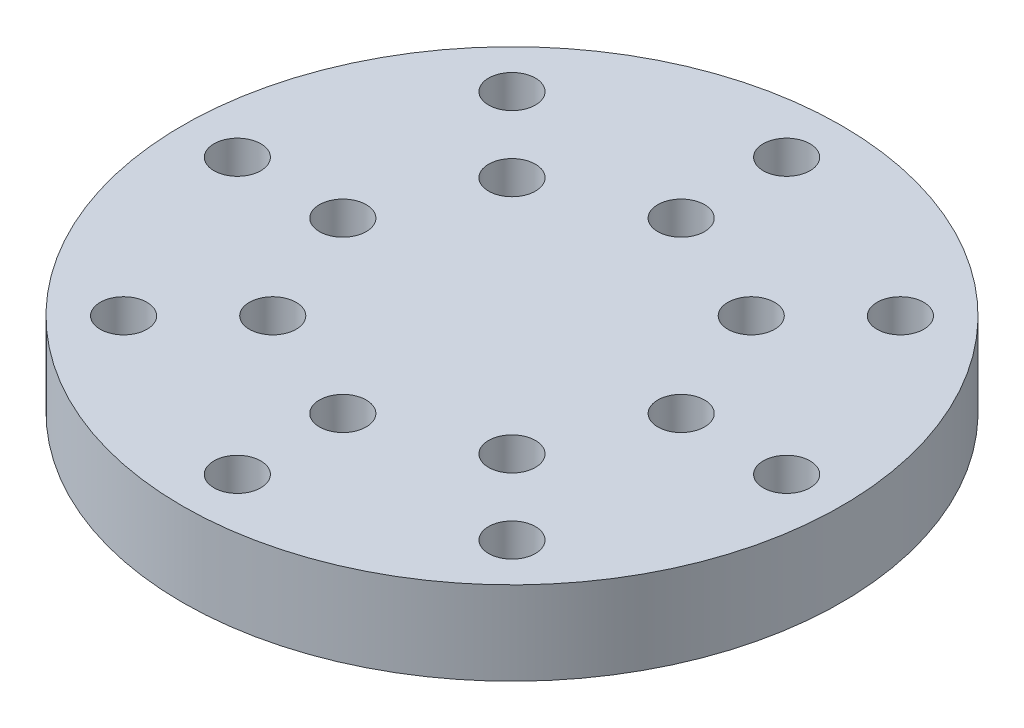
ISO-10303-21;
HEADER;
FILE_DESCRIPTION(('STEP AP214'),'2;1');
FILE_NAME('part.step','',(''),(''),'','','');
FILE_SCHEMA(('AUTOMOTIVE_DESIGN { 1 0 10303 214 1 1 1 1 }'));
ENDSEC;
DATA;
#1=APPLICATION_CONTEXT('core data for automotive mechanical design processes');
#2=APPLICATION_PROTOCOL_DEFINITION('international standard','automotive_design',2000,#1);
#3=PRODUCT_CONTEXT('',#1,'mechanical');
#4=PRODUCT('Part','Part','',(#3));
#5=PRODUCT_RELATED_PRODUCT_CATEGORY('part','',(#4));
#6=PRODUCT_DEFINITION_FORMATION('','',#4);
#7=PRODUCT_DEFINITION_CONTEXT('part definition',#1,'design');
#8=PRODUCT_DEFINITION('design','',#6,#7);
#9=PRODUCT_DEFINITION_SHAPE('','',#8);
#10=(LENGTH_UNIT() NAMED_UNIT(*) SI_UNIT(.MILLI.,.METRE.));
#11=(NAMED_UNIT(*) PLANE_ANGLE_UNIT() SI_UNIT($,.RADIAN.));
#12=(NAMED_UNIT(*) SI_UNIT($,.STERADIAN.) SOLID_ANGLE_UNIT());
#13=UNCERTAINTY_MEASURE_WITH_UNIT(LENGTH_MEASURE(1.E-05),#10,'distance_accuracy_value','');
#14=(GEOMETRIC_REPRESENTATION_CONTEXT(3) GLOBAL_UNCERTAINTY_ASSIGNED_CONTEXT((#13)) GLOBAL_UNIT_ASSIGNED_CONTEXT((#10,
#11,#12)) REPRESENTATION_CONTEXT('',''));
#15=CARTESIAN_POINT('',(0.,0.,0.));
#16=DIRECTION('',(0.,0.,1.));
#17=DIRECTION('',(1.,0.,0.));
#18=AXIS2_PLACEMENT_3D('',#15,#16,#17);
#19=CARTESIAN_POINT('',(0.,4.826,0.));
#20=DIRECTION('',(0.,-1.,0.));
#21=DIRECTION('',(0.,0.,-1.));
#22=AXIS2_PLACEMENT_3D('',#19,#20,#21);
#23=CYLINDRICAL_SURFACE('',#22,19.05);
#24=CARTESIAN_POINT('',(0.,4.826,0.));
#25=DIRECTION('',(0.,1.,0.));
#26=DIRECTION('',(0.,0.,1.));
#27=AXIS2_PLACEMENT_3D('',#24,#25,#26);
#28=CIRCLE('',#27,19.05);
#29=CARTESIAN_POINT('',(0.,4.826,19.05));
#30=VERTEX_POINT('',#29);
#31=EDGE_CURVE('E10',#30,#30,#28,.T.);
#32=ORIENTED_EDGE('',*,*,#31,.F.);
#33=EDGE_LOOP('',(#32));
#34=FACE_BOUND('',#33,.T.);
#35=CARTESIAN_POINT('',(0.,0.,0.));
#36=DIRECTION('',(0.,1.,0.));
#37=DIRECTION('',(0.,0.,1.));
#38=AXIS2_PLACEMENT_3D('',#35,#36,#37);
#39=CIRCLE('',#38,19.05);
#40=CARTESIAN_POINT('',(0.,0.,19.05));
#41=VERTEX_POINT('',#40);
#42=EDGE_CURVE('E34',#41,#41,#39,.T.);
#43=ORIENTED_EDGE('',*,*,#42,.T.);
#44=EDGE_LOOP('',(#43));
#45=FACE_BOUND('',#44,.T.);
#46=ADVANCED_FACE('F31',(#34,#45),#23,.T.);
#47=CARTESIAN_POINT('',(0.,4.826,0.));
#48=DIRECTION('',(0.,1.,0.));
#49=DIRECTION('',(0.,0.,1.));
#50=AXIS2_PLACEMENT_3D('',#47,#48,#49);
#51=PLANE('',#50);
#52=CARTESIAN_POINT('',(9.779,4.826,0.));
#53=DIRECTION('',(0.,1.,0.));
#54=DIRECTION('',(-1.,0.,0.));
#55=AXIS2_PLACEMENT_3D('',#52,#53,#54);
#56=CIRCLE('',#55,1.35254999999999);
#57=CARTESIAN_POINT('',(8.42645000000001,4.826,0.));
#58=VERTEX_POINT('',#57);
#59=EDGE_CURVE('E120',#58,#58,#56,.T.);
#60=ORIENTED_EDGE('',*,*,#59,.F.);
#61=EDGE_LOOP('',(#60));
#62=FACE_BOUND('',#61,.T.);
#63=CARTESIAN_POINT('',(6.91479721322321,4.826,6.91479721322328));
#64=DIRECTION('',(0.,1.,0.));
#65=DIRECTION('',(-0.707106781186544,0.,-0.707106781186551));
#66=AXIS2_PLACEMENT_3D('',#63,#64,#65);
#67=CIRCLE('',#66,1.35254999999999);
#68=CARTESIAN_POINT('',(5.95839993632936,4.826,5.95839993632942));
#69=VERTEX_POINT('',#68);
#70=EDGE_CURVE('E114',#69,#69,#67,.T.);
#71=ORIENTED_EDGE('',*,*,#70,.F.);
#72=EDGE_LOOP('',(#71));
#73=FACE_BOUND('',#72,.T.);
#74=CARTESIAN_POINT('',(0.,4.826,9.779));
#75=DIRECTION('',(0.,1.,0.));
#76=DIRECTION('',(0.,0.,-1.));
#77=AXIS2_PLACEMENT_3D('',#74,#75,#76);
#78=CIRCLE('',#77,1.35254999999999);
#79=CARTESIAN_POINT('',(0.,4.826,8.42645000000001));
#80=VERTEX_POINT('',#79);
#81=EDGE_CURVE('E106',#80,#80,#78,.T.);
#82=ORIENTED_EDGE('',*,*,#81,.F.);
#83=EDGE_LOOP('',(#82));
#84=FACE_BOUND('',#83,.T.);
#85=CARTESIAN_POINT('',(-6.91479721322331,4.826,6.91479721322319));
#86=DIRECTION('',(0.,1.,0.));
#87=DIRECTION('',(0.707106781186554,0.,-0.707106781186541));
#88=AXIS2_PLACEMENT_3D('',#85,#86,#87);
#89=CIRCLE('',#88,1.35254999999999);
#90=CARTESIAN_POINT('',(-5.95839993632944,4.826,5.95839993632934));
#91=VERTEX_POINT('',#90);
#92=EDGE_CURVE('E107',#91,#91,#89,.T.);
#93=ORIENTED_EDGE('',*,*,#92,.F.);
#94=EDGE_LOOP('',(#93));
#95=FACE_BOUND('',#94,.T.);
#96=CARTESIAN_POINT('',(-9.779,4.826,-1.02429588037641E-13));
#97=DIRECTION('',(0.,1.,0.));
#98=DIRECTION('',(1.,0.,0.));
#99=AXIS2_PLACEMENT_3D('',#96,#97,#98);
#100=CIRCLE('',#99,1.35254999999999);
#101=CARTESIAN_POINT('',(-8.42645000000001,4.826,0.));
#102=VERTEX_POINT('',#101);
#103=EDGE_CURVE('E130',#102,#102,#100,.T.);
#104=ORIENTED_EDGE('',*,*,#103,.F.);
#105=EDGE_LOOP('',(#104));
#106=FACE_BOUND('',#105,.T.);
#107=CARTESIAN_POINT('',(-6.91479721322316,4.826,-6.91479721322333));
#108=DIRECTION('',(0.,1.,0.));
#109=DIRECTION('',(0.707106781186539,0.,0.707106781186556));
#110=AXIS2_PLACEMENT_3D('',#107,#108,#109);
#111=CIRCLE('',#110,1.35254999999999);
#112=CARTESIAN_POINT('',(-5.95839993632932,4.826,-5.95839993632946));
#113=VERTEX_POINT('',#112);
#114=EDGE_CURVE('E131',#113,#113,#111,.T.);
#115=ORIENTED_EDGE('',*,*,#114,.F.);
#116=EDGE_LOOP('',(#115));
#117=FACE_BOUND('',#116,.T.);
#118=CARTESIAN_POINT('',(6.91479721322326,4.826,-6.91479721322324));
#119=DIRECTION('',(0.,1.,0.));
#120=DIRECTION('',(-0.707106781186549,0.,0.707106781186546));
#121=AXIS2_PLACEMENT_3D('',#118,#119,#120);
#122=CIRCLE('',#121,1.35254999999999);
#123=CARTESIAN_POINT('',(5.9583999363294,4.826,-5.95839993632938));
#124=VERTEX_POINT('',#123);
#125=EDGE_CURVE('E99',#124,#124,#122,.T.);
#126=ORIENTED_EDGE('',*,*,#125,.F.);
#127=EDGE_LOOP('',(#126));
#128=FACE_BOUND('',#127,.T.);
#129=CARTESIAN_POINT('',(15.875,4.826,0.));
#130=DIRECTION('',(0.,1.,0.));
#131=DIRECTION('',(-1.,0.,0.));
#132=AXIS2_PLACEMENT_3D('',#129,#130,#131);
#133=CIRCLE('',#132,1.35254999999999);
#134=CARTESIAN_POINT('',(14.52245,4.826,0.));
#135=VERTEX_POINT('',#134);
#136=EDGE_CURVE('E78',#135,#135,#133,.T.);
#137=ORIENTED_EDGE('',*,*,#136,.F.);
#138=EDGE_LOOP('',(#137));
#139=FACE_BOUND('',#138,.T.);
#140=CARTESIAN_POINT('',(11.2253201513364,4.826,11.2253201513365));
#141=DIRECTION('',(0.,1.,0.));
#142=DIRECTION('',(-0.707106781186544,0.,-0.707106781186551));
#143=AXIS2_PLACEMENT_3D('',#140,#141,#142);
#144=CIRCLE('',#143,1.35254999999999);
#145=CARTESIAN_POINT('',(10.2689228744425,4.826,10.2689228744426));
#146=VERTEX_POINT('',#145);
#147=EDGE_CURVE('E72',#146,#146,#144,.T.);
#148=ORIENTED_EDGE('',*,*,#147,.F.);
#149=EDGE_LOOP('',(#148));
#150=FACE_BOUND('',#149,.T.);
#151=CARTESIAN_POINT('',(0.,4.826,15.875));
#152=DIRECTION('',(0.,1.,0.));
#153=DIRECTION('',(0.,0.,-1.));
#154=AXIS2_PLACEMENT_3D('',#151,#152,#153);
#155=CIRCLE('',#154,1.35254999999999);
#156=CARTESIAN_POINT('',(0.,4.826,14.52245));
#157=VERTEX_POINT('',#156);
#158=EDGE_CURVE('E64',#157,#157,#155,.T.);
#159=ORIENTED_EDGE('',*,*,#158,.F.);
#160=EDGE_LOOP('',(#159));
#161=FACE_BOUND('',#160,.T.);
#162=CARTESIAN_POINT('',(-11.2253201513365,4.826,11.2253201513363));
#163=DIRECTION('',(0.,1.,0.));
#164=DIRECTION('',(0.707106781186554,0.,-0.707106781186541));
#165=AXIS2_PLACEMENT_3D('',#162,#163,#164);
#166=CIRCLE('',#165,1.35254999999999);
#167=CARTESIAN_POINT('',(-10.2689228744427,4.826,10.2689228744425));
#168=VERTEX_POINT('',#167);
#169=EDGE_CURVE('E65',#168,#168,#166,.T.);
#170=ORIENTED_EDGE('',*,*,#169,.F.);
#171=EDGE_LOOP('',(#170));
#172=FACE_BOUND('',#171,.T.);
#173=CARTESIAN_POINT('',(-15.875,4.826,-1.66281798762404E-13));
#174=DIRECTION('',(0.,1.,0.));
#175=DIRECTION('',(1.,0.,0.));
#176=AXIS2_PLACEMENT_3D('',#173,#174,#175);
#177=CIRCLE('',#176,1.35254999999999);
#178=CARTESIAN_POINT('',(-14.52245,4.826,-1.52114589507848E-13));
#179=VERTEX_POINT('',#178);
#180=EDGE_CURVE('E88',#179,#179,#177,.T.);
#181=ORIENTED_EDGE('',*,*,#180,.F.);
#182=EDGE_LOOP('',(#181));
#183=FACE_BOUND('',#182,.T.);
#184=CARTESIAN_POINT('',(-11.2253201513363,4.826,-11.2253201513366));
#185=DIRECTION('',(0.,1.,0.));
#186=DIRECTION('',(0.707106781186539,0.,0.707106781186556));
#187=AXIS2_PLACEMENT_3D('',#184,#185,#186);
#188=CIRCLE('',#187,1.35254999999999);
#189=CARTESIAN_POINT('',(-10.2689228744425,4.826,-10.2689228744427));
#190=VERTEX_POINT('',#189);
#191=EDGE_CURVE('E89',#190,#190,#188,.T.);
#192=ORIENTED_EDGE('',*,*,#191,.F.);
#193=EDGE_LOOP('',(#192));
#194=FACE_BOUND('',#193,.T.);
#195=CARTESIAN_POINT('',(11.2253201513365,4.826,-11.2253201513364));
#196=DIRECTION('',(0.,1.,0.));
#197=DIRECTION('',(-0.707106781186549,0.,0.707106781186546));
#198=AXIS2_PLACEMENT_3D('',#195,#196,#197);
#199=CIRCLE('',#198,1.35254999999999);
#200=CARTESIAN_POINT('',(10.2689228744426,4.826,-10.2689228744426));
#201=VERTEX_POINT('',#200);
#202=EDGE_CURVE('E57',#201,#201,#199,.T.);
#203=ORIENTED_EDGE('',*,*,#202,.F.);
#204=EDGE_LOOP('',(#203));
#205=FACE_BOUND('',#204,.T.);
#206=CARTESIAN_POINT('',(0.,4.826,-15.875));
#207=DIRECTION('',(0.,1.,0.));
#208=DIRECTION('',(0.,0.,1.));
#209=AXIS2_PLACEMENT_3D('',#206,#207,#208);
#210=CIRCLE('',#209,1.35254999999999);
#211=CARTESIAN_POINT('',(0.,4.826,-14.52245));
#212=VERTEX_POINT('',#211);
#213=EDGE_CURVE('E48',#212,#212,#210,.T.);
#214=ORIENTED_EDGE('',*,*,#213,.F.);
#215=EDGE_LOOP('',(#214));
#216=FACE_BOUND('',#215,.T.);
#217=CARTESIAN_POINT('',(0.,4.826,-9.779));
#218=DIRECTION('',(0.,1.,0.));
#219=DIRECTION('',(0.,0.,1.));
#220=AXIS2_PLACEMENT_3D('',#217,#218,#219);
#221=CIRCLE('',#220,1.35254999999999);
#222=CARTESIAN_POINT('',(0.,4.826,-8.42645000000001));
#223=VERTEX_POINT('',#222);
#224=EDGE_CURVE('E41',#223,#223,#221,.T.);
#225=ORIENTED_EDGE('',*,*,#224,.F.);
#226=EDGE_LOOP('',(#225));
#227=FACE_BOUND('',#226,.T.);
#228=ORIENTED_EDGE('',*,*,#31,.T.);
#229=EDGE_LOOP('',(#228));
#230=FACE_BOUND('',#229,.T.);
#231=ADVANCED_FACE('F142',(#62,#73,#84,#95,#106,#117,#128,#139,#150,#161,#172,#183,#194,#205,
#216,#227,#230),#51,.T.);
#232=CARTESIAN_POINT('',(0.,0.,0.));
#233=DIRECTION('',(0.,1.,0.));
#234=DIRECTION('',(0.,0.,1.));
#235=AXIS2_PLACEMENT_3D('',#232,#233,#234);
#236=PLANE('',#235);
#237=CARTESIAN_POINT('',(9.779,0.,0.));
#238=DIRECTION('',(0.,-1.,0.));
#239=DIRECTION('',(1.,0.,0.));
#240=AXIS2_PLACEMENT_3D('',#237,#238,#239);
#241=CIRCLE('',#240,1.35254999999999);
#242=CARTESIAN_POINT('',(11.13155,0.,0.));
#243=VERTEX_POINT('',#242);
#244=EDGE_CURVE('E102',#243,#243,#241,.T.);
#245=ORIENTED_EDGE('',*,*,#244,.F.);
#246=EDGE_LOOP('',(#245));
#247=FACE_BOUND('',#246,.T.);
#248=CARTESIAN_POINT('',(6.91479721322321,0.,6.91479721322328));
#249=DIRECTION('',(0.,-1.,0.));
#250=DIRECTION('',(0.707106781186544,0.,0.707106781186551));
#251=AXIS2_PLACEMENT_3D('',#248,#249,#250);
#252=CIRCLE('',#251,1.35254999999999);
#253=CARTESIAN_POINT('',(7.87119449011706,0.,7.87119449011715));
#254=VERTEX_POINT('',#253);
#255=EDGE_CURVE('E117',#254,#254,#252,.T.);
#256=ORIENTED_EDGE('',*,*,#255,.F.);
#257=EDGE_LOOP('',(#256));
#258=FACE_BOUND('',#257,.T.);
#259=CARTESIAN_POINT('',(0.,0.,9.779));
#260=DIRECTION('',(0.,-1.,0.));
#261=DIRECTION('',(0.,0.,1.));
#262=AXIS2_PLACEMENT_3D('',#259,#260,#261);
#263=CIRCLE('',#262,1.35254999999999);
#264=CARTESIAN_POINT('',(0.,0.,11.13155));
#265=VERTEX_POINT('',#264);
#266=EDGE_CURVE('E111',#265,#265,#263,.T.);
#267=ORIENTED_EDGE('',*,*,#266,.F.);
#268=EDGE_LOOP('',(#267));
#269=FACE_BOUND('',#268,.T.);
#270=CARTESIAN_POINT('',(-6.91479721322331,0.,6.91479721322319));
#271=DIRECTION('',(0.,-1.,0.));
#272=DIRECTION('',(-0.707106781186554,0.,0.707106781186541));
#273=AXIS2_PLACEMENT_3D('',#270,#271,#272);
#274=CIRCLE('',#273,1.35254999999999);
#275=CARTESIAN_POINT('',(-7.87119449011717,0.,7.87119449011704));
#276=VERTEX_POINT('',#275);
#277=EDGE_CURVE('E103',#276,#276,#274,.T.);
#278=ORIENTED_EDGE('',*,*,#277,.F.);
#279=EDGE_LOOP('',(#278));
#280=FACE_BOUND('',#279,.T.);
#281=CARTESIAN_POINT('',(-9.779,0.,-1.02429588037641E-13));
#282=DIRECTION('',(0.,-1.,0.));
#283=DIRECTION('',(-1.,0.,0.));
#284=AXIS2_PLACEMENT_3D('',#281,#282,#283);
#285=CIRCLE('',#284,1.35254999999999);
#286=CARTESIAN_POINT('',(-11.13155,0.,-1.16596797292198E-13));
#287=VERTEX_POINT('',#286);
#288=EDGE_CURVE('E110',#287,#287,#285,.T.);
#289=ORIENTED_EDGE('',*,*,#288,.F.);
#290=EDGE_LOOP('',(#289));
#291=FACE_BOUND('',#290,.T.);
#292=CARTESIAN_POINT('',(-6.91479721322316,0.,-6.91479721322333));
#293=DIRECTION('',(0.,-1.,0.));
#294=DIRECTION('',(-0.707106781186539,0.,-0.707106781186556));
#295=AXIS2_PLACEMENT_3D('',#292,#293,#294);
#296=CIRCLE('',#295,1.35254999999999);
#297=CARTESIAN_POINT('',(-7.87119449011701,0.,-7.8711944901172));
#298=VERTEX_POINT('',#297);
#299=EDGE_CURVE('E127',#298,#298,#296,.T.);
#300=ORIENTED_EDGE('',*,*,#299,.F.);
#301=EDGE_LOOP('',(#300));
#302=FACE_BOUND('',#301,.T.);
#303=CARTESIAN_POINT('',(6.91479721322326,0.,-6.91479721322324));
#304=DIRECTION('',(0.,-1.,0.));
#305=DIRECTION('',(0.707106781186549,0.,-0.707106781186546));
#306=AXIS2_PLACEMENT_3D('',#303,#304,#305);
#307=CIRCLE('',#306,1.35254999999999);
#308=CARTESIAN_POINT('',(7.87119449011712,0.,-7.87119449011709));
#309=VERTEX_POINT('',#308);
#310=EDGE_CURVE('E92',#309,#309,#307,.T.);
#311=ORIENTED_EDGE('',*,*,#310,.F.);
#312=EDGE_LOOP('',(#311));
#313=FACE_BOUND('',#312,.T.);
#314=CARTESIAN_POINT('',(15.875,0.,0.));
#315=DIRECTION('',(0.,-1.,0.));
#316=DIRECTION('',(1.,0.,0.));
#317=AXIS2_PLACEMENT_3D('',#314,#315,#316);
#318=CIRCLE('',#317,1.35254999999999);
#319=CARTESIAN_POINT('',(17.22755,0.,0.));
#320=VERTEX_POINT('',#319);
#321=EDGE_CURVE('E60',#320,#320,#318,.T.);
#322=ORIENTED_EDGE('',*,*,#321,.F.);
#323=EDGE_LOOP('',(#322));
#324=FACE_BOUND('',#323,.T.);
#325=CARTESIAN_POINT('',(11.2253201513364,0.,11.2253201513365));
#326=DIRECTION('',(0.,-1.,0.));
#327=DIRECTION('',(0.707106781186544,0.,0.707106781186551));
#328=AXIS2_PLACEMENT_3D('',#325,#326,#327);
#329=CIRCLE('',#328,1.35254999999999);
#330=CARTESIAN_POINT('',(12.1817174282302,0.,12.1817174282304));
#331=VERTEX_POINT('',#330);
#332=EDGE_CURVE('E75',#331,#331,#329,.T.);
#333=ORIENTED_EDGE('',*,*,#332,.F.);
#334=EDGE_LOOP('',(#333));
#335=FACE_BOUND('',#334,.T.);
#336=CARTESIAN_POINT('',(0.,0.,15.875));
#337=DIRECTION('',(0.,-1.,0.));
#338=DIRECTION('',(0.,0.,1.));
#339=AXIS2_PLACEMENT_3D('',#336,#337,#338);
#340=CIRCLE('',#339,1.35254999999999);
#341=CARTESIAN_POINT('',(0.,0.,17.22755));
#342=VERTEX_POINT('',#341);
#343=EDGE_CURVE('E69',#342,#342,#340,.T.);
#344=ORIENTED_EDGE('',*,*,#343,.F.);
#345=EDGE_LOOP('',(#344));
#346=FACE_BOUND('',#345,.T.);
#347=CARTESIAN_POINT('',(-11.2253201513365,0.,11.2253201513363));
#348=DIRECTION('',(0.,-1.,0.));
#349=DIRECTION('',(-0.707106781186554,0.,0.707106781186541));
#350=AXIS2_PLACEMENT_3D('',#347,#348,#349);
#351=CIRCLE('',#350,1.35254999999999);
#352=CARTESIAN_POINT('',(-12.1817174282304,0.,12.1817174282302));
#353=VERTEX_POINT('',#352);
#354=EDGE_CURVE('E61',#353,#353,#351,.T.);
#355=ORIENTED_EDGE('',*,*,#354,.F.);
#356=EDGE_LOOP('',(#355));
#357=FACE_BOUND('',#356,.T.);
#358=CARTESIAN_POINT('',(-15.875,0.,-1.66281798762404E-13));
#359=DIRECTION('',(0.,-1.,0.));
#360=DIRECTION('',(-1.,0.,0.));
#361=AXIS2_PLACEMENT_3D('',#358,#359,#360);
#362=CIRCLE('',#361,1.35254999999999);
#363=CARTESIAN_POINT('',(-17.22755,0.,-1.80449008016961E-13));
#364=VERTEX_POINT('',#363);
#365=EDGE_CURVE('E68',#364,#364,#362,.T.);
#366=ORIENTED_EDGE('',*,*,#365,.F.);
#367=EDGE_LOOP('',(#366));
#368=FACE_BOUND('',#367,.T.);
#369=CARTESIAN_POINT('',(-11.2253201513363,0.,-11.2253201513366));
#370=DIRECTION('',(0.,-1.,0.));
#371=DIRECTION('',(-0.707106781186539,0.,-0.707106781186556));
#372=AXIS2_PLACEMENT_3D('',#369,#370,#371);
#373=CIRCLE('',#372,1.35254999999999);
#374=CARTESIAN_POINT('',(-12.1817174282302,0.,-12.1817174282304));
#375=VERTEX_POINT('',#374);
#376=EDGE_CURVE('E85',#375,#375,#373,.T.);
#377=ORIENTED_EDGE('',*,*,#376,.F.);
#378=EDGE_LOOP('',(#377));
#379=FACE_BOUND('',#378,.T.);
#380=CARTESIAN_POINT('',(11.2253201513365,0.,-11.2253201513364));
#381=DIRECTION('',(0.,-1.,0.));
#382=DIRECTION('',(0.707106781186549,0.,-0.707106781186546));
#383=AXIS2_PLACEMENT_3D('',#380,#381,#382);
#384=CIRCLE('',#383,1.35254999999999);
#385=CARTESIAN_POINT('',(12.1817174282303,0.,-12.1817174282303));
#386=VERTEX_POINT('',#385);
#387=EDGE_CURVE('E54',#386,#386,#384,.T.);
#388=ORIENTED_EDGE('',*,*,#387,.F.);
#389=EDGE_LOOP('',(#388));
#390=FACE_BOUND('',#389,.T.);
#391=CARTESIAN_POINT('',(0.,0.,-15.875));
#392=DIRECTION('',(0.,-1.,0.));
#393=DIRECTION('',(0.,0.,-1.));
#394=AXIS2_PLACEMENT_3D('',#391,#392,#393);
#395=CIRCLE('',#394,1.35254999999999);
#396=CARTESIAN_POINT('',(0.,0.,-17.22755));
#397=VERTEX_POINT('',#396);
#398=EDGE_CURVE('E51',#397,#397,#395,.T.);
#399=ORIENTED_EDGE('',*,*,#398,.F.);
#400=EDGE_LOOP('',(#399));
#401=FACE_BOUND('',#400,.T.);
#402=CARTESIAN_POINT('',(0.,0.,-9.779));
#403=DIRECTION('',(0.,-1.,0.));
#404=DIRECTION('',(0.,0.,-1.));
#405=AXIS2_PLACEMENT_3D('',#402,#403,#404);
#406=CIRCLE('',#405,1.35254999999999);
#407=CARTESIAN_POINT('',(0.,0.,-11.13155));
#408=VERTEX_POINT('',#407);
#409=EDGE_CURVE('E45',#408,#408,#406,.T.);
#410=ORIENTED_EDGE('',*,*,#409,.F.);
#411=EDGE_LOOP('',(#410));
#412=FACE_BOUND('',#411,.T.);
#413=ORIENTED_EDGE('',*,*,#42,.F.);
#414=EDGE_LOOP('',(#413));
#415=FACE_BOUND('',#414,.T.);
#416=ADVANCED_FACE('F145',(#247,#258,#269,#280,#291,#302,#313,#324,#335,#346,#357,#368,#379,
#390,#401,#412,#415),#236,.F.);
#417=CARTESIAN_POINT('',(0.,0.,-9.779));
#418=DIRECTION('',(0.,-1.,0.));
#419=DIRECTION('',(0.,0.,-1.));
#420=AXIS2_PLACEMENT_3D('',#417,#418,#419);
#421=CYLINDRICAL_SURFACE('',#420,1.35254999999999);
#422=ORIENTED_EDGE('',*,*,#224,.T.);
#423=EDGE_LOOP('',(#422));
#424=FACE_BOUND('',#423,.T.);
#425=ORIENTED_EDGE('',*,*,#409,.T.);
#426=EDGE_LOOP('',(#425));
#427=FACE_BOUND('',#426,.T.);
#428=ADVANCED_FACE('F170',(#424,#427),#421,.F.);
#429=CARTESIAN_POINT('',(0.,0.,-15.875));
#430=DIRECTION('',(0.,-1.,0.));
#431=DIRECTION('',(0.,0.,-1.));
#432=AXIS2_PLACEMENT_3D('',#429,#430,#431);
#433=CYLINDRICAL_SURFACE('',#432,1.35254999999999);
#434=ORIENTED_EDGE('',*,*,#213,.T.);
#435=EDGE_LOOP('',(#434));
#436=FACE_BOUND('',#435,.T.);
#437=ORIENTED_EDGE('',*,*,#398,.T.);
#438=EDGE_LOOP('',(#437));
#439=FACE_BOUND('',#438,.T.);
#440=ADVANCED_FACE('F173',(#436,#439),#433,.F.);
#441=CARTESIAN_POINT('',(11.2253201513365,0.,-11.2253201513364));
#442=DIRECTION('',(0.,-1.,0.));
#443=DIRECTION('',(0.707106781186549,0.,-0.707106781186546));
#444=AXIS2_PLACEMENT_3D('',#441,#442,#443);
#445=CYLINDRICAL_SURFACE('',#444,1.35254999999999);
#446=ORIENTED_EDGE('',*,*,#202,.T.);
#447=EDGE_LOOP('',(#446));
#448=FACE_BOUND('',#447,.T.);
#449=ORIENTED_EDGE('',*,*,#387,.T.);
#450=EDGE_LOOP('',(#449));
#451=FACE_BOUND('',#450,.T.);
#452=ADVANCED_FACE('F205',(#448,#451),#445,.F.);
#453=CARTESIAN_POINT('',(-11.2253201513363,0.,-11.2253201513366));
#454=DIRECTION('',(0.,-1.,0.));
#455=DIRECTION('',(-0.707106781186539,0.,-0.707106781186556));
#456=AXIS2_PLACEMENT_3D('',#453,#454,#455);
#457=CYLINDRICAL_SURFACE('',#456,1.35254999999999);
#458=ORIENTED_EDGE('',*,*,#191,.T.);
#459=EDGE_LOOP('',(#458));
#460=FACE_BOUND('',#459,.T.);
#461=ORIENTED_EDGE('',*,*,#376,.T.);
#462=EDGE_LOOP('',(#461));
#463=FACE_BOUND('',#462,.T.);
#464=ADVANCED_FACE('F212',(#460,#463),#457,.F.);
#465=CARTESIAN_POINT('',(-15.875,0.,-1.66281798762404E-13));
#466=DIRECTION('',(0.,-1.,0.));
#467=DIRECTION('',(-1.,0.,0.));
#468=AXIS2_PLACEMENT_3D('',#465,#466,#467);
#469=CYLINDRICAL_SURFACE('',#468,1.35254999999999);
#470=ORIENTED_EDGE('',*,*,#180,.T.);
#471=EDGE_LOOP('',(#470));
#472=FACE_BOUND('',#471,.T.);
#473=ORIENTED_EDGE('',*,*,#365,.T.);
#474=EDGE_LOOP('',(#473));
#475=FACE_BOUND('',#474,.T.);
#476=ADVANCED_FACE('F220',(#472,#475),#469,.F.);
#477=CARTESIAN_POINT('',(-11.2253201513365,0.,11.2253201513363));
#478=DIRECTION('',(0.,-1.,0.));
#479=DIRECTION('',(-0.707106781186554,0.,0.707106781186541));
#480=AXIS2_PLACEMENT_3D('',#477,#478,#479);
#481=CYLINDRICAL_SURFACE('',#480,1.35254999999999);
#482=ORIENTED_EDGE('',*,*,#169,.T.);
#483=EDGE_LOOP('',(#482));
#484=FACE_BOUND('',#483,.T.);
#485=ORIENTED_EDGE('',*,*,#354,.T.);
#486=EDGE_LOOP('',(#485));
#487=FACE_BOUND('',#486,.T.);
#488=ADVANCED_FACE('F228',(#484,#487),#481,.F.);
#489=CARTESIAN_POINT('',(0.,0.,15.875));
#490=DIRECTION('',(0.,-1.,0.));
#491=DIRECTION('',(0.,0.,1.));
#492=AXIS2_PLACEMENT_3D('',#489,#490,#491);
#493=CYLINDRICAL_SURFACE('',#492,1.35254999999999);
#494=ORIENTED_EDGE('',*,*,#158,.T.);
#495=EDGE_LOOP('',(#494));
#496=FACE_BOUND('',#495,.T.);
#497=ORIENTED_EDGE('',*,*,#343,.T.);
#498=EDGE_LOOP('',(#497));
#499=FACE_BOUND('',#498,.T.);
#500=ADVANCED_FACE('F236',(#496,#499),#493,.F.);
#501=CARTESIAN_POINT('',(11.2253201513364,0.,11.2253201513365));
#502=DIRECTION('',(0.,-1.,0.));
#503=DIRECTION('',(0.707106781186544,0.,0.707106781186551));
#504=AXIS2_PLACEMENT_3D('',#501,#502,#503);
#505=CYLINDRICAL_SURFACE('',#504,1.35254999999999);
#506=ORIENTED_EDGE('',*,*,#147,.T.);
#507=EDGE_LOOP('',(#506));
#508=FACE_BOUND('',#507,.T.);
#509=ORIENTED_EDGE('',*,*,#332,.T.);
#510=EDGE_LOOP('',(#509));
#511=FACE_BOUND('',#510,.T.);
#512=ADVANCED_FACE('F244',(#508,#511),#505,.F.);
#513=CARTESIAN_POINT('',(15.875,0.,0.));
#514=DIRECTION('',(0.,-1.,0.));
#515=DIRECTION('',(1.,0.,0.));
#516=AXIS2_PLACEMENT_3D('',#513,#514,#515);
#517=CYLINDRICAL_SURFACE('',#516,1.35254999999999);
#518=ORIENTED_EDGE('',*,*,#136,.T.);
#519=EDGE_LOOP('',(#518));
#520=FACE_BOUND('',#519,.T.);
#521=ORIENTED_EDGE('',*,*,#321,.T.);
#522=EDGE_LOOP('',(#521));
#523=FACE_BOUND('',#522,.T.);
#524=ADVANCED_FACE('F252',(#520,#523),#517,.F.);
#525=CARTESIAN_POINT('',(6.91479721322326,0.,-6.91479721322324));
#526=DIRECTION('',(0.,-1.,0.));
#527=DIRECTION('',(0.707106781186549,0.,-0.707106781186546));
#528=AXIS2_PLACEMENT_3D('',#525,#526,#527);
#529=CYLINDRICAL_SURFACE('',#528,1.35254999999999);
#530=ORIENTED_EDGE('',*,*,#125,.T.);
#531=EDGE_LOOP('',(#530));
#532=FACE_BOUND('',#531,.T.);
#533=ORIENTED_EDGE('',*,*,#310,.T.);
#534=EDGE_LOOP('',(#533));
#535=FACE_BOUND('',#534,.T.);
#536=ADVANCED_FACE('F260',(#532,#535),#529,.F.);
#537=CARTESIAN_POINT('',(-6.91479721322316,0.,-6.91479721322333));
#538=DIRECTION('',(0.,-1.,0.));
#539=DIRECTION('',(-0.707106781186539,0.,-0.707106781186556));
#540=AXIS2_PLACEMENT_3D('',#537,#538,#539);
#541=CYLINDRICAL_SURFACE('',#540,1.35254999999999);
#542=ORIENTED_EDGE('',*,*,#114,.T.);
#543=EDGE_LOOP('',(#542));
#544=FACE_BOUND('',#543,.T.);
#545=ORIENTED_EDGE('',*,*,#299,.T.);
#546=EDGE_LOOP('',(#545));
#547=FACE_BOUND('',#546,.T.);
#548=ADVANCED_FACE('F268',(#544,#547),#541,.F.);
#549=CARTESIAN_POINT('',(-9.779,0.,-1.02429588037641E-13));
#550=DIRECTION('',(0.,-1.,0.));
#551=DIRECTION('',(-1.,0.,0.));
#552=AXIS2_PLACEMENT_3D('',#549,#550,#551);
#553=CYLINDRICAL_SURFACE('',#552,1.35254999999999);
#554=ORIENTED_EDGE('',*,*,#103,.T.);
#555=EDGE_LOOP('',(#554));
#556=FACE_BOUND('',#555,.T.);
#557=ORIENTED_EDGE('',*,*,#288,.T.);
#558=EDGE_LOOP('',(#557));
#559=FACE_BOUND('',#558,.T.);
#560=ADVANCED_FACE('F139',(#556,#559),#553,.F.);
#561=CARTESIAN_POINT('',(-6.91479721322331,0.,6.91479721322319));
#562=DIRECTION('',(0.,-1.,0.));
#563=DIRECTION('',(-0.707106781186554,0.,0.707106781186541));
#564=AXIS2_PLACEMENT_3D('',#561,#562,#563);
#565=CYLINDRICAL_SURFACE('',#564,1.35254999999999);
#566=ORIENTED_EDGE('',*,*,#92,.T.);
#567=EDGE_LOOP('',(#566));
#568=FACE_BOUND('',#567,.T.);
#569=ORIENTED_EDGE('',*,*,#277,.T.);
#570=EDGE_LOOP('',(#569));
#571=FACE_BOUND('',#570,.T.);
#572=ADVANCED_FACE('F283',(#568,#571),#565,.F.);
#573=CARTESIAN_POINT('',(0.,0.,9.779));
#574=DIRECTION('',(0.,-1.,0.));
#575=DIRECTION('',(0.,0.,1.));
#576=AXIS2_PLACEMENT_3D('',#573,#574,#575);
#577=CYLINDRICAL_SURFACE('',#576,1.35254999999999);
#578=ORIENTED_EDGE('',*,*,#81,.T.);
#579=EDGE_LOOP('',(#578));
#580=FACE_BOUND('',#579,.T.);
#581=ORIENTED_EDGE('',*,*,#266,.T.);
#582=EDGE_LOOP('',(#581));
#583=FACE_BOUND('',#582,.T.);
#584=ADVANCED_FACE('F290',(#580,#583),#577,.F.);
#585=CARTESIAN_POINT('',(6.91479721322321,0.,6.91479721322328));
#586=DIRECTION('',(0.,-1.,0.));
#587=DIRECTION('',(0.707106781186544,0.,0.707106781186551));
#588=AXIS2_PLACEMENT_3D('',#585,#586,#587);
#589=CYLINDRICAL_SURFACE('',#588,1.35254999999999);
#590=ORIENTED_EDGE('',*,*,#70,.T.);
#591=EDGE_LOOP('',(#590));
#592=FACE_BOUND('',#591,.T.);
#593=ORIENTED_EDGE('',*,*,#255,.T.);
#594=EDGE_LOOP('',(#593));
#595=FACE_BOUND('',#594,.T.);
#596=ADVANCED_FACE('F298',(#592,#595),#589,.F.);
#597=CARTESIAN_POINT('',(9.779,0.,0.));
#598=DIRECTION('',(0.,-1.,0.));
#599=DIRECTION('',(1.,0.,0.));
#600=AXIS2_PLACEMENT_3D('',#597,#598,#599);
#601=CYLINDRICAL_SURFACE('',#600,1.35254999999999);
#602=ORIENTED_EDGE('',*,*,#59,.T.);
#603=EDGE_LOOP('',(#602));
#604=FACE_BOUND('',#603,.T.);
#605=ORIENTED_EDGE('',*,*,#244,.T.);
#606=EDGE_LOOP('',(#605));
#607=FACE_BOUND('',#606,.T.);
#608=ADVANCED_FACE('F306',(#604,#607),#601,.F.);
#609=CLOSED_SHELL('',(#46,#231,#416,#428,#440,#452,#464,#476,#488,#500,#512,#524,#536,#548,#560,
#572,#584,#596,#608));
#610=MANIFOLD_SOLID_BREP('B2',#609);
#611=ADVANCED_BREP_SHAPE_REPRESENTATION('',(#18,#610),#14);
#612=SHAPE_DEFINITION_REPRESENTATION(#9,#611);
ENDSEC;
END-ISO-10303-21;
